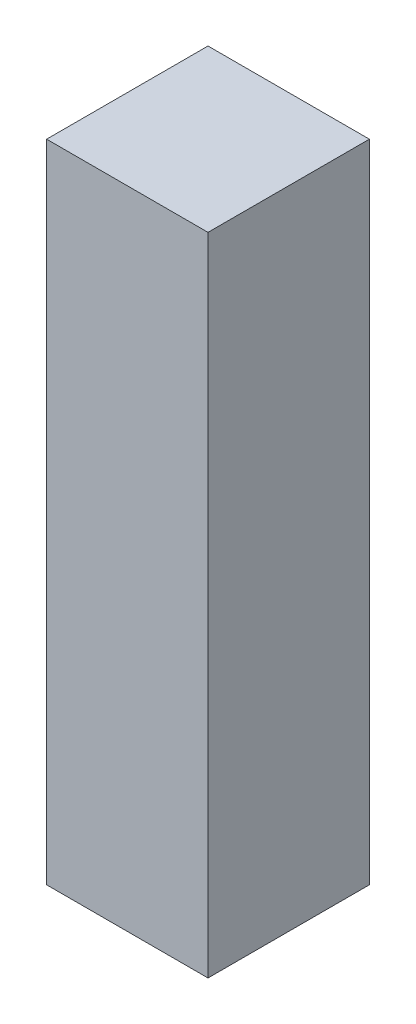
ISO-10303-21;
HEADER;
FILE_DESCRIPTION(('STEP AP214'),'2;1');
FILE_NAME('part.step','',(''),(''),'','','');
FILE_SCHEMA(('AUTOMOTIVE_DESIGN { 1 0 10303 214 1 1 1 1 }'));
ENDSEC;
DATA;
#1=APPLICATION_CONTEXT('core data for automotive mechanical design processes');
#2=APPLICATION_PROTOCOL_DEFINITION('international standard','automotive_design',2000,#1);
#3=PRODUCT_CONTEXT('',#1,'mechanical');
#4=PRODUCT('Part','Part','',(#3));
#5=PRODUCT_RELATED_PRODUCT_CATEGORY('part','',(#4));
#6=PRODUCT_DEFINITION_FORMATION('','',#4);
#7=PRODUCT_DEFINITION_CONTEXT('part definition',#1,'design');
#8=PRODUCT_DEFINITION('design','',#6,#7);
#9=PRODUCT_DEFINITION_SHAPE('','',#8);
#10=(LENGTH_UNIT() NAMED_UNIT(*) SI_UNIT(.MILLI.,.METRE.));
#11=(NAMED_UNIT(*) PLANE_ANGLE_UNIT() SI_UNIT($,.RADIAN.));
#12=(NAMED_UNIT(*) SI_UNIT($,.STERADIAN.) SOLID_ANGLE_UNIT());
#13=UNCERTAINTY_MEASURE_WITH_UNIT(LENGTH_MEASURE(1.E-05),#10,'distance_accuracy_value','');
#14=(GEOMETRIC_REPRESENTATION_CONTEXT(3) GLOBAL_UNCERTAINTY_ASSIGNED_CONTEXT((#13)) GLOBAL_UNIT_ASSIGNED_CONTEXT((#10,
#11,#12)) REPRESENTATION_CONTEXT('',''));
#15=CARTESIAN_POINT('',(0.,0.,0.));
#16=DIRECTION('',(0.,0.,1.));
#17=DIRECTION('',(1.,0.,0.));
#18=AXIS2_PLACEMENT_3D('',#15,#16,#17);
#19=CARTESIAN_POINT('',(1.5875,-6.35254,3.175));
#20=DIRECTION('',(-1.,0.,0.));
#21=DIRECTION('',(0.,0.,1.));
#22=AXIS2_PLACEMENT_3D('',#19,#20,#21);
#23=PLANE('',#22);
#24=DIRECTION('',(0.,1.,0.));
#25=VECTOR('',#24,1.);
#26=CARTESIAN_POINT('',(1.5875,-6.35254,0.));
#27=LINE('',#26,#25);
#28=CARTESIAN_POINT('',(1.5875,-6.35254,0.));
#29=VERTEX_POINT('',#28);
#30=CARTESIAN_POINT('',(1.5875,6.35254,0.));
#31=VERTEX_POINT('',#30);
#32=EDGE_CURVE('E112',#29,#31,#27,.T.);
#33=ORIENTED_EDGE('',*,*,#32,.T.);
#34=DIRECTION('',(0.,0.,-1.));
#35=VECTOR('',#34,1.);
#36=CARTESIAN_POINT('',(1.5875,6.35254,3.175));
#37=LINE('',#36,#35);
#38=CARTESIAN_POINT('',(1.5875,6.35254,3.175));
#39=VERTEX_POINT('',#38);
#40=EDGE_CURVE('E11',#39,#31,#37,.T.);
#41=ORIENTED_EDGE('',*,*,#40,.F.);
#42=DIRECTION('',(0.,1.,0.));
#43=VECTOR('',#42,1.);
#44=CARTESIAN_POINT('',(1.5875,-6.35254,3.175));
#45=LINE('',#44,#43);
#46=CARTESIAN_POINT('',(1.5875,-6.35254,3.175));
#47=VERTEX_POINT('',#46);
#48=EDGE_CURVE('E96',#47,#39,#45,.T.);
#49=ORIENTED_EDGE('',*,*,#48,.F.);
#50=DIRECTION('',(0.,0.,-1.));
#51=VECTOR('',#50,1.);
#52=CARTESIAN_POINT('',(1.5875,-6.35254,3.175));
#53=LINE('',#52,#51);
#54=EDGE_CURVE('E108',#47,#29,#53,.T.);
#55=ORIENTED_EDGE('',*,*,#54,.T.);
#56=EDGE_LOOP('',(#33,#41,#49,#55));
#57=FACE_BOUND('',#56,.T.);
#58=ADVANCED_FACE('F44',(#57),#23,.F.);
#59=CARTESIAN_POINT('',(-1.5875,6.35254,3.175));
#60=DIRECTION('',(0.,-1.,0.));
#61=DIRECTION('',(0.,0.,-1.));
#62=AXIS2_PLACEMENT_3D('',#59,#60,#61);
#63=PLANE('',#62);
#64=DIRECTION('',(-1.,0.,0.));
#65=VECTOR('',#64,1.);
#66=CARTESIAN_POINT('',(-1.5875,6.35254,0.));
#67=LINE('',#66,#65);
#68=CARTESIAN_POINT('',(-1.5875,6.35254,0.));
#69=VERTEX_POINT('',#68);
#70=EDGE_CURVE('E101',#31,#69,#67,.T.);
#71=ORIENTED_EDGE('',*,*,#70,.T.);
#72=DIRECTION('',(0.,0.,-1.));
#73=VECTOR('',#72,1.);
#74=CARTESIAN_POINT('',(-1.5875,6.35254,3.175));
#75=LINE('',#74,#73);
#76=CARTESIAN_POINT('',(-1.5875,6.35254,3.175));
#77=VERTEX_POINT('',#76);
#78=EDGE_CURVE('E53',#77,#69,#75,.T.);
#79=ORIENTED_EDGE('',*,*,#78,.F.);
#80=DIRECTION('',(-1.,0.,0.));
#81=VECTOR('',#80,1.);
#82=CARTESIAN_POINT('',(-1.5875,6.35254,3.175));
#83=LINE('',#82,#81);
#84=EDGE_CURVE('E91',#39,#77,#83,.T.);
#85=ORIENTED_EDGE('',*,*,#84,.F.);
#86=ORIENTED_EDGE('',*,*,#40,.T.);
#87=EDGE_LOOP('',(#71,#79,#85,#86));
#88=FACE_BOUND('',#87,.T.);
#89=ADVANCED_FACE('F100',(#88),#63,.F.);
#90=CARTESIAN_POINT('',(-1.5875,-6.35254,3.175));
#91=DIRECTION('',(1.,0.,0.));
#92=DIRECTION('',(0.,0.,-1.));
#93=AXIS2_PLACEMENT_3D('',#90,#91,#92);
#94=PLANE('',#93);
#95=DIRECTION('',(0.,-1.,0.));
#96=VECTOR('',#95,1.);
#97=CARTESIAN_POINT('',(-1.5875,-6.35254,0.));
#98=LINE('',#97,#96);
#99=CARTESIAN_POINT('',(-1.5875,-6.35254,0.));
#100=VERTEX_POINT('',#99);
#101=EDGE_CURVE('E78',#69,#100,#98,.T.);
#102=ORIENTED_EDGE('',*,*,#101,.T.);
#103=DIRECTION('',(0.,0.,-1.));
#104=VECTOR('',#103,1.);
#105=CARTESIAN_POINT('',(-1.5875,-6.35254,3.175));
#106=LINE('',#105,#104);
#107=CARTESIAN_POINT('',(-1.5875,-6.35254,3.175));
#108=VERTEX_POINT('',#107);
#109=EDGE_CURVE('E103',#108,#100,#106,.T.);
#110=ORIENTED_EDGE('',*,*,#109,.F.);
#111=DIRECTION('',(0.,-1.,0.));
#112=VECTOR('',#111,1.);
#113=CARTESIAN_POINT('',(-1.5875,-6.35254,3.175));
#114=LINE('',#113,#112);
#115=EDGE_CURVE('E94',#77,#108,#114,.T.);
#116=ORIENTED_EDGE('',*,*,#115,.F.);
#117=ORIENTED_EDGE('',*,*,#78,.T.);
#118=EDGE_LOOP('',(#102,#110,#116,#117));
#119=FACE_BOUND('',#118,.T.);
#120=ADVANCED_FACE('F104',(#119),#94,.F.);
#121=CARTESIAN_POINT('',(-1.5875,-6.35254,3.175));
#122=DIRECTION('',(0.,1.,0.));
#123=DIRECTION('',(0.,0.,1.));
#124=AXIS2_PLACEMENT_3D('',#121,#122,#123);
#125=PLANE('',#124);
#126=DIRECTION('',(1.,0.,0.));
#127=VECTOR('',#126,1.);
#128=CARTESIAN_POINT('',(-1.5875,-6.35254,0.));
#129=LINE('',#128,#127);
#130=EDGE_CURVE('E84',#100,#29,#129,.T.);
#131=ORIENTED_EDGE('',*,*,#130,.T.);
#132=ORIENTED_EDGE('',*,*,#54,.F.);
#133=DIRECTION('',(1.,0.,0.));
#134=VECTOR('',#133,1.);
#135=CARTESIAN_POINT('',(-1.5875,-6.35254,3.175));
#136=LINE('',#135,#134);
#137=EDGE_CURVE('E61',#108,#47,#136,.T.);
#138=ORIENTED_EDGE('',*,*,#137,.F.);
#139=ORIENTED_EDGE('',*,*,#109,.T.);
#140=EDGE_LOOP('',(#131,#132,#138,#139));
#141=FACE_BOUND('',#140,.T.);
#142=ADVANCED_FACE('F125',(#141),#125,.F.);
#143=CARTESIAN_POINT('',(0.,0.,3.175));
#144=DIRECTION('',(0.,0.,-1.));
#145=DIRECTION('',(-1.,0.,0.));
#146=AXIS2_PLACEMENT_3D('',#143,#144,#145);
#147=PLANE('',#146);
#148=ORIENTED_EDGE('',*,*,#48,.T.);
#149=ORIENTED_EDGE('',*,*,#84,.T.);
#150=ORIENTED_EDGE('',*,*,#115,.T.);
#151=ORIENTED_EDGE('',*,*,#137,.T.);
#152=EDGE_LOOP('',(#148,#149,#150,#151));
#153=FACE_BOUND('',#152,.T.);
#154=ADVANCED_FACE('F92',(#153),#147,.F.);
#155=CARTESIAN_POINT('',(0.,0.,0.));
#156=DIRECTION('',(0.,0.,-1.));
#157=DIRECTION('',(-1.,0.,0.));
#158=AXIS2_PLACEMENT_3D('',#155,#156,#157);
#159=PLANE('',#158);
#160=ORIENTED_EDGE('',*,*,#32,.F.);
#161=ORIENTED_EDGE('',*,*,#130,.F.);
#162=ORIENTED_EDGE('',*,*,#101,.F.);
#163=ORIENTED_EDGE('',*,*,#70,.F.);
#164=EDGE_LOOP('',(#160,#161,#162,#163));
#165=FACE_BOUND('',#164,.T.);
#166=ADVANCED_FACE('F128',(#165),#159,.T.);
#167=CLOSED_SHELL('',(#58,#89,#120,#142,#154,#166));
#168=MANIFOLD_SOLID_BREP('B2',#167);
#169=ADVANCED_BREP_SHAPE_REPRESENTATION('',(#18,#168),#14);
#170=SHAPE_DEFINITION_REPRESENTATION(#9,#169);
ENDSEC;
END-ISO-10303-21;
